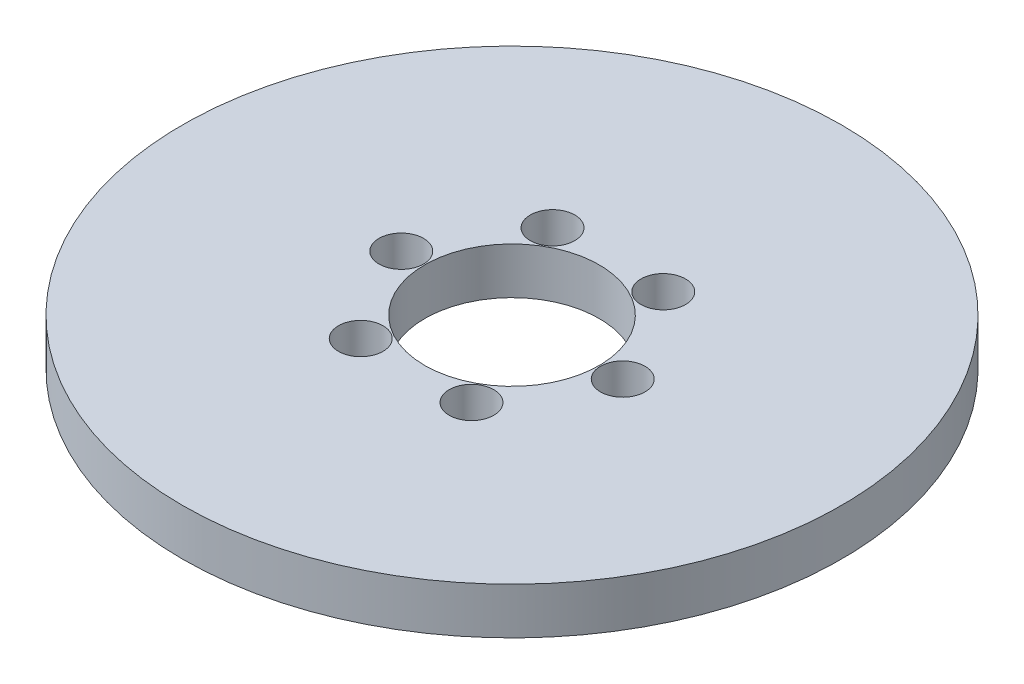
ISO-10303-21;
HEADER;
FILE_DESCRIPTION(('STEP AP214'),'2;1');
FILE_NAME('part.step','',(''),(''),'','','');
FILE_SCHEMA(('AUTOMOTIVE_DESIGN { 1 0 10303 214 1 1 1 1 }'));
ENDSEC;
DATA;
#1=APPLICATION_CONTEXT('core data for automotive mechanical design processes');
#2=APPLICATION_PROTOCOL_DEFINITION('international standard','automotive_design',2000,#1);
#3=PRODUCT_CONTEXT('',#1,'mechanical');
#4=PRODUCT('Part','Part','',(#3));
#5=PRODUCT_RELATED_PRODUCT_CATEGORY('part','',(#4));
#6=PRODUCT_DEFINITION_FORMATION('','',#4);
#7=PRODUCT_DEFINITION_CONTEXT('part definition',#1,'design');
#8=PRODUCT_DEFINITION('design','',#6,#7);
#9=PRODUCT_DEFINITION_SHAPE('','',#8);
#10=(LENGTH_UNIT() NAMED_UNIT(*) SI_UNIT(.MILLI.,.METRE.));
#11=(NAMED_UNIT(*) PLANE_ANGLE_UNIT() SI_UNIT($,.RADIAN.));
#12=(NAMED_UNIT(*) SI_UNIT($,.STERADIAN.) SOLID_ANGLE_UNIT());
#13=UNCERTAINTY_MEASURE_WITH_UNIT(LENGTH_MEASURE(1.E-05),#10,'distance_accuracy_value','');
#14=(GEOMETRIC_REPRESENTATION_CONTEXT(3) GLOBAL_UNCERTAINTY_ASSIGNED_CONTEXT((#13)) GLOBAL_UNIT_ASSIGNED_CONTEXT((#10,
#11,#12)) REPRESENTATION_CONTEXT('',''));
#15=CARTESIAN_POINT('',(0.,0.,0.));
#16=DIRECTION('',(0.,0.,1.));
#17=DIRECTION('',(1.,0.,0.));
#18=AXIS2_PLACEMENT_3D('',#15,#16,#17);
#19=CARTESIAN_POINT('',(0.,12.,0.));
#20=DIRECTION('',(0.,-1.,0.));
#21=DIRECTION('',(0.,0.,-1.));
#22=AXIS2_PLACEMENT_3D('',#19,#20,#21);
#23=CYLINDRICAL_SURFACE('',#22,85.);
#24=CARTESIAN_POINT('',(0.,12.,0.));
#25=DIRECTION('',(0.,1.,0.));
#26=DIRECTION('',(0.,0.,1.));
#27=AXIS2_PLACEMENT_3D('',#24,#25,#26);
#28=CIRCLE('',#27,85.);
#29=CARTESIAN_POINT('',(0.,12.,85.));
#30=VERTEX_POINT('',#29);
#31=EDGE_CURVE('E10',#30,#30,#28,.T.);
#32=ORIENTED_EDGE('',*,*,#31,.F.);
#33=EDGE_LOOP('',(#32));
#34=FACE_BOUND('',#33,.T.);
#35=CARTESIAN_POINT('',(0.,0.,0.));
#36=DIRECTION('',(0.,1.,0.));
#37=DIRECTION('',(0.,0.,1.));
#38=AXIS2_PLACEMENT_3D('',#35,#36,#37);
#39=CIRCLE('',#38,85.);
#40=CARTESIAN_POINT('',(0.,0.,85.));
#41=VERTEX_POINT('',#40);
#42=EDGE_CURVE('E37',#41,#41,#39,.T.);
#43=ORIENTED_EDGE('',*,*,#42,.T.);
#44=EDGE_LOOP('',(#43));
#45=FACE_BOUND('',#44,.T.);
#46=ADVANCED_FACE('F40',(#34,#45),#23,.T.);
#47=CARTESIAN_POINT('',(0.,12.,0.));
#48=DIRECTION('',(0.,1.,0.));
#49=DIRECTION('',(0.,0.,1.));
#50=AXIS2_PLACEMENT_3D('',#47,#48,#49);
#51=PLANE('',#50);
#52=CARTESIAN_POINT('',(-14.2803185229176,12.,-24.7342372299595));
#53=DIRECTION('',(0.,1.,0.));
#54=DIRECTION('',(-0.866025403784433,0.,0.50000000000001));
#55=AXIS2_PLACEMENT_3D('',#52,#53,#54);
#56=CIRCLE('',#55,5.7444583782801);
#57=CARTESIAN_POINT('',(-19.2551654094905,12.,-21.8620080408194));
#58=VERTEX_POINT('',#57);
#59=EDGE_CURVE('E70',#58,#58,#56,.T.);
#60=ORIENTED_EDGE('',*,*,#59,.F.);
#61=EDGE_LOOP('',(#60));
#62=FACE_BOUND('',#61,.T.);
#63=CARTESIAN_POINT('',(14.2803185229171,12.,-24.7342372299598));
#64=DIRECTION('',(0.,1.,0.));
#65=DIRECTION('',(-0.866025403784443,0.,-0.499999999999992));
#66=AXIS2_PLACEMENT_3D('',#63,#64,#65);
#67=CIRCLE('',#66,5.7444583782801);
#68=CARTESIAN_POINT('',(9.30547163634411,12.,-27.6064664190998));
#69=VERTEX_POINT('',#68);
#70=EDGE_CURVE('E71',#69,#69,#67,.T.);
#71=ORIENTED_EDGE('',*,*,#70,.F.);
#72=EDGE_LOOP('',(#71));
#73=FACE_BOUND('',#72,.T.);
#74=CARTESIAN_POINT('',(28.5606370458346,12.,0.));
#75=DIRECTION('',(0.,1.,0.));
#76=DIRECTION('',(0.,0.,-1.));
#77=AXIS2_PLACEMENT_3D('',#74,#75,#76);
#78=CIRCLE('',#77,5.7444583782801);
#79=CARTESIAN_POINT('',(28.5606370458346,12.,-5.7444583782801));
#80=VERTEX_POINT('',#79);
#81=EDGE_CURVE('E78',#80,#80,#78,.T.);
#82=ORIENTED_EDGE('',*,*,#81,.F.);
#83=EDGE_LOOP('',(#82));
#84=FACE_BOUND('',#83,.T.);
#85=CARTESIAN_POINT('',(14.2803185229174,12.,24.7342372299596));
#86=DIRECTION('',(0.,1.,0.));
#87=DIRECTION('',(0.866025403784436,0.,-0.500000000000004));
#88=AXIS2_PLACEMENT_3D('',#85,#86,#87);
#89=CIRCLE('',#88,5.7444583782801);
#90=CARTESIAN_POINT('',(19.2551654094903,12.,21.8620080408195));
#91=VERTEX_POINT('',#90);
#92=EDGE_CURVE('E84',#91,#91,#89,.T.);
#93=ORIENTED_EDGE('',*,*,#92,.F.);
#94=EDGE_LOOP('',(#93));
#95=FACE_BOUND('',#94,.T.);
#96=CARTESIAN_POINT('',(-14.2803185229172,12.,24.7342372299597));
#97=DIRECTION('',(0.,1.,0.));
#98=DIRECTION('',(0.86602540378444,0.,0.499999999999998));
#99=AXIS2_PLACEMENT_3D('',#96,#97,#98);
#100=CIRCLE('',#99,5.7444583782801);
#101=CARTESIAN_POINT('',(-9.3054716363443,12.,27.6064664190997));
#102=VERTEX_POINT('',#101);
#103=EDGE_CURVE('E61',#102,#102,#100,.T.);
#104=ORIENTED_EDGE('',*,*,#103,.F.);
#105=EDGE_LOOP('',(#104));
#106=FACE_BOUND('',#105,.T.);
#107=CARTESIAN_POINT('',(-28.5606370458346,12.,0.));
#108=DIRECTION('',(0.,1.,0.));
#109=DIRECTION('',(0.,0.,1.));
#110=AXIS2_PLACEMENT_3D('',#107,#108,#109);
#111=CIRCLE('',#110,5.7444583782801);
#112=CARTESIAN_POINT('',(-28.5606370458346,12.,5.7444583782801));
#113=VERTEX_POINT('',#112);
#114=EDGE_CURVE('E54',#113,#113,#111,.T.);
#115=ORIENTED_EDGE('',*,*,#114,.F.);
#116=EDGE_LOOP('',(#115));
#117=FACE_BOUND('',#116,.T.);
#118=CARTESIAN_POINT('',(0.,12.,0.));
#119=DIRECTION('',(0.,1.,0.));
#120=DIRECTION('',(0.,0.,1.));
#121=AXIS2_PLACEMENT_3D('',#118,#119,#120);
#122=CIRCLE('',#121,22.5);
#123=CARTESIAN_POINT('',(0.,12.,22.5));
#124=VERTEX_POINT('',#123);
#125=EDGE_CURVE('E50',#124,#124,#122,.T.);
#126=ORIENTED_EDGE('',*,*,#125,.F.);
#127=EDGE_LOOP('',(#126));
#128=FACE_BOUND('',#127,.T.);
#129=ORIENTED_EDGE('',*,*,#31,.T.);
#130=EDGE_LOOP('',(#129));
#131=FACE_BOUND('',#130,.T.);
#132=ADVANCED_FACE('F99',(#62,#73,#84,#95,#106,#117,#128,#131),#51,.T.);
#133=CARTESIAN_POINT('',(0.,0.,0.));
#134=DIRECTION('',(0.,1.,0.));
#135=DIRECTION('',(0.,0.,1.));
#136=AXIS2_PLACEMENT_3D('',#133,#134,#135);
#137=PLANE('',#136);
#138=CARTESIAN_POINT('',(0.,0.,0.));
#139=DIRECTION('',(0.,1.,0.));
#140=DIRECTION('',(0.,0.,1.));
#141=AXIS2_PLACEMENT_3D('',#138,#139,#140);
#142=CIRCLE('',#141,22.5);
#143=CARTESIAN_POINT('',(0.,0.,22.5));
#144=VERTEX_POINT('',#143);
#145=EDGE_CURVE('E47',#144,#144,#142,.T.);
#146=ORIENTED_EDGE('',*,*,#145,.T.);
#147=EDGE_LOOP('',(#146));
#148=FACE_BOUND('',#147,.T.);
#149=ORIENTED_EDGE('',*,*,#42,.F.);
#150=EDGE_LOOP('',(#149));
#151=FACE_BOUND('',#150,.T.);
#152=ADVANCED_FACE('F103',(#148,#151),#137,.F.);
#153=CARTESIAN_POINT('',(0.,12.,0.));
#154=DIRECTION('',(0.,-1.,0.));
#155=DIRECTION('',(0.,0.,-1.));
#156=AXIS2_PLACEMENT_3D('',#153,#154,#155);
#157=CYLINDRICAL_SURFACE('',#156,22.5);
#158=ORIENTED_EDGE('',*,*,#125,.T.);
#159=EDGE_LOOP('',(#158));
#160=FACE_BOUND('',#159,.T.);
#161=ORIENTED_EDGE('',*,*,#145,.F.);
#162=EDGE_LOOP('',(#161));
#163=FACE_BOUND('',#162,.T.);
#164=ADVANCED_FACE('F115',(#160,#163),#157,.F.);
#165=CARTESIAN_POINT('',(-28.5606370458346,3.35929411930055,0.));
#166=DIRECTION('',(0.,1.,0.));
#167=DIRECTION('',(0.,0.,1.));
#168=AXIS2_PLACEMENT_3D('',#165,#166,#167);
#169=CYLINDRICAL_SURFACE('',#168,5.7444583782801);
#170=CARTESIAN_POINT('',(-28.5606370458346,3.35929411930055,0.));
#171=DIRECTION('',(0.,1.,0.));
#172=DIRECTION('',(0.,0.,1.));
#173=AXIS2_PLACEMENT_3D('',#170,#171,#172);
#174=CIRCLE('',#173,5.7444583782801);
#175=CARTESIAN_POINT('',(-28.5606370458346,3.35929411930055,5.7444583782801));
#176=VERTEX_POINT('',#175);
#177=EDGE_CURVE('E55',#176,#176,#174,.T.);
#178=ORIENTED_EDGE('',*,*,#177,.F.);
#179=EDGE_LOOP('',(#178));
#180=FACE_BOUND('',#179,.T.);
#181=ORIENTED_EDGE('',*,*,#114,.T.);
#182=EDGE_LOOP('',(#181));
#183=FACE_BOUND('',#182,.T.);
#184=ADVANCED_FACE('F113',(#180,#183),#169,.F.);
#185=CARTESIAN_POINT('',(-28.5606370458346,3.35929411930055,0.));
#186=DIRECTION('',(0.,1.,0.));
#187=DIRECTION('',(0.,0.,1.));
#188=AXIS2_PLACEMENT_3D('',#185,#186,#187);
#189=PLANE('',#188);
#190=ORIENTED_EDGE('',*,*,#177,.T.);
#191=EDGE_LOOP('',(#190));
#192=FACE_BOUND('',#191,.T.);
#193=ADVANCED_FACE('F144',(#192),#189,.T.);
#194=CARTESIAN_POINT('',(-14.2803185229172,3.35929411930055,24.7342372299597));
#195=DIRECTION('',(0.,1.,0.));
#196=DIRECTION('',(0.,0.,1.));
#197=AXIS2_PLACEMENT_3D('',#194,#195,#196);
#198=CYLINDRICAL_SURFACE('',#197,5.7444583782801);
#199=CARTESIAN_POINT('',(-14.2803185229172,3.35929411930055,24.7342372299597));
#200=DIRECTION('',(0.,1.,0.));
#201=DIRECTION('',(0.86602540378444,0.,0.499999999999998));
#202=AXIS2_PLACEMENT_3D('',#199,#200,#201);
#203=CIRCLE('',#202,5.7444583782801);
#204=CARTESIAN_POINT('',(-9.3054716363443,3.35929411930055,27.6064664190997));
#205=VERTEX_POINT('',#204);
#206=EDGE_CURVE('E59',#205,#205,#203,.T.);
#207=ORIENTED_EDGE('',*,*,#206,.F.);
#208=EDGE_LOOP('',(#207));
#209=FACE_BOUND('',#208,.T.);
#210=ORIENTED_EDGE('',*,*,#103,.T.);
#211=EDGE_LOOP('',(#210));
#212=FACE_BOUND('',#211,.T.);
#213=ADVANCED_FACE('F153',(#209,#212),#198,.F.);
#214=CARTESIAN_POINT('',(-14.2803185229172,3.35929411930055,24.7342372299597));
#215=DIRECTION('',(0.,1.,0.));
#216=DIRECTION('',(0.86602540378444,0.,0.499999999999998));
#217=AXIS2_PLACEMENT_3D('',#214,#215,#216);
#218=PLANE('',#217);
#219=ORIENTED_EDGE('',*,*,#206,.T.);
#220=EDGE_LOOP('',(#219));
#221=FACE_BOUND('',#220,.T.);
#222=ADVANCED_FACE('F96',(#221),#218,.T.);
#223=CARTESIAN_POINT('',(14.2803185229174,3.35929411930055,24.7342372299596));
#224=DIRECTION('',(0.,1.,0.));
#225=DIRECTION('',(0.,0.,1.));
#226=AXIS2_PLACEMENT_3D('',#223,#224,#225);
#227=CYLINDRICAL_SURFACE('',#226,5.7444583782801);
#228=CARTESIAN_POINT('',(14.2803185229174,3.35929411930055,24.7342372299596));
#229=DIRECTION('',(0.,1.,0.));
#230=DIRECTION('',(0.866025403784436,0.,-0.500000000000004));
#231=AXIS2_PLACEMENT_3D('',#228,#229,#230);
#232=CIRCLE('',#231,5.7444583782801);
#233=CARTESIAN_POINT('',(19.2551654094903,3.35929411930055,21.8620080408195));
#234=VERTEX_POINT('',#233);
#235=EDGE_CURVE('E63',#234,#234,#232,.T.);
#236=ORIENTED_EDGE('',*,*,#235,.F.);
#237=EDGE_LOOP('',(#236));
#238=FACE_BOUND('',#237,.T.);
#239=ORIENTED_EDGE('',*,*,#92,.T.);
#240=EDGE_LOOP('',(#239));
#241=FACE_BOUND('',#240,.T.);
#242=ADVANCED_FACE('F91',(#238,#241),#227,.F.);
#243=CARTESIAN_POINT('',(14.2803185229174,3.35929411930055,24.7342372299596));
#244=DIRECTION('',(0.,1.,0.));
#245=DIRECTION('',(0.866025403784436,0.,-0.500000000000004));
#246=AXIS2_PLACEMENT_3D('',#243,#244,#245);
#247=PLANE('',#246);
#248=ORIENTED_EDGE('',*,*,#235,.T.);
#249=EDGE_LOOP('',(#248));
#250=FACE_BOUND('',#249,.T.);
#251=ADVANCED_FACE('F93',(#250),#247,.T.);
#252=CARTESIAN_POINT('',(28.5606370458346,3.35929411930055,0.));
#253=DIRECTION('',(0.,1.,0.));
#254=DIRECTION('',(0.,0.,1.));
#255=AXIS2_PLACEMENT_3D('',#252,#253,#254);
#256=CYLINDRICAL_SURFACE('',#255,5.7444583782801);
#257=CARTESIAN_POINT('',(28.5606370458346,3.35929411930055,0.));
#258=DIRECTION('',(0.,1.,0.));
#259=DIRECTION('',(0.,0.,-1.));
#260=AXIS2_PLACEMENT_3D('',#257,#258,#259);
#261=CIRCLE('',#260,5.7444583782801);
#262=CARTESIAN_POINT('',(28.5606370458346,3.35929411930055,-5.7444583782801));
#263=VERTEX_POINT('',#262);
#264=EDGE_CURVE('E85',#263,#263,#261,.T.);
#265=ORIENTED_EDGE('',*,*,#264,.F.);
#266=EDGE_LOOP('',(#265));
#267=FACE_BOUND('',#266,.T.);
#268=ORIENTED_EDGE('',*,*,#81,.T.);
#269=EDGE_LOOP('',(#268));
#270=FACE_BOUND('',#269,.T.);
#271=ADVANCED_FACE('F187',(#267,#270),#256,.F.);
#272=CARTESIAN_POINT('',(28.5606370458346,3.35929411930055,0.));
#273=DIRECTION('',(0.,1.,0.));
#274=DIRECTION('',(0.,0.,-1.));
#275=AXIS2_PLACEMENT_3D('',#272,#273,#274);
#276=PLANE('',#275);
#277=ORIENTED_EDGE('',*,*,#264,.T.);
#278=EDGE_LOOP('',(#277));
#279=FACE_BOUND('',#278,.T.);
#280=ADVANCED_FACE('F198',(#279),#276,.T.);
#281=CARTESIAN_POINT('',(14.2803185229171,3.35929411930055,-24.7342372299598));
#282=DIRECTION('',(0.,1.,0.));
#283=DIRECTION('',(0.,0.,1.));
#284=AXIS2_PLACEMENT_3D('',#281,#282,#283);
#285=CYLINDRICAL_SURFACE('',#284,5.7444583782801);
#286=CARTESIAN_POINT('',(14.2803185229171,3.35929411930055,-24.7342372299598));
#287=DIRECTION('',(0.,1.,0.));
#288=DIRECTION('',(-0.866025403784443,0.,-0.499999999999992));
#289=AXIS2_PLACEMENT_3D('',#286,#287,#288);
#290=CIRCLE('',#289,5.7444583782801);
#291=CARTESIAN_POINT('',(9.30547163634411,3.35929411930055,-27.6064664190998));
#292=VERTEX_POINT('',#291);
#293=EDGE_CURVE('E76',#292,#292,#290,.T.);
#294=ORIENTED_EDGE('',*,*,#293,.F.);
#295=EDGE_LOOP('',(#294));
#296=FACE_BOUND('',#295,.T.);
#297=ORIENTED_EDGE('',*,*,#70,.T.);
#298=EDGE_LOOP('',(#297));
#299=FACE_BOUND('',#298,.T.);
#300=ADVANCED_FACE('F202',(#296,#299),#285,.F.);
#301=CARTESIAN_POINT('',(14.2803185229171,3.35929411930055,-24.7342372299598));
#302=DIRECTION('',(0.,1.,0.));
#303=DIRECTION('',(-0.866025403784443,0.,-0.499999999999992));
#304=AXIS2_PLACEMENT_3D('',#301,#302,#303);
#305=PLANE('',#304);
#306=ORIENTED_EDGE('',*,*,#293,.T.);
#307=EDGE_LOOP('',(#306));
#308=FACE_BOUND('',#307,.T.);
#309=ADVANCED_FACE('F212',(#308),#305,.T.);
#310=CARTESIAN_POINT('',(-14.2803185229176,3.35929411930055,-24.7342372299595));
#311=DIRECTION('',(0.,1.,0.));
#312=DIRECTION('',(0.,0.,1.));
#313=AXIS2_PLACEMENT_3D('',#310,#311,#312);
#314=CYLINDRICAL_SURFACE('',#313,5.7444583782801);
#315=CARTESIAN_POINT('',(-14.2803185229176,3.35929411930055,-24.7342372299595));
#316=DIRECTION('',(0.,1.,0.));
#317=DIRECTION('',(-0.866025403784433,0.,0.50000000000001));
#318=AXIS2_PLACEMENT_3D('',#315,#316,#317);
#319=CIRCLE('',#318,5.7444583782801);
#320=CARTESIAN_POINT('',(-19.2551654094905,3.35929411930055,-21.8620080408194));
#321=VERTEX_POINT('',#320);
#322=EDGE_CURVE('E69',#321,#321,#319,.T.);
#323=ORIENTED_EDGE('',*,*,#322,.F.);
#324=EDGE_LOOP('',(#323));
#325=FACE_BOUND('',#324,.T.);
#326=ORIENTED_EDGE('',*,*,#59,.T.);
#327=EDGE_LOOP('',(#326));
#328=FACE_BOUND('',#327,.T.);
#329=ADVANCED_FACE('F224',(#325,#328),#314,.F.);
#330=CARTESIAN_POINT('',(-14.2803185229176,3.35929411930055,-24.7342372299595));
#331=DIRECTION('',(0.,1.,0.));
#332=DIRECTION('',(-0.866025403784433,0.,0.50000000000001));
#333=AXIS2_PLACEMENT_3D('',#330,#331,#332);
#334=PLANE('',#333);
#335=ORIENTED_EDGE('',*,*,#322,.T.);
#336=EDGE_LOOP('',(#335));
#337=FACE_BOUND('',#336,.T.);
#338=ADVANCED_FACE('F235',(#337),#334,.T.);
#339=CLOSED_SHELL('',(#46,#132,#152,#164,#184,#193,#213,#222,#242,#251,#271,#280,#300,#309,#329,#338));
#340=MANIFOLD_SOLID_BREP('B2',#339);
#341=ADVANCED_BREP_SHAPE_REPRESENTATION('',(#18,#340),#14);
#342=SHAPE_DEFINITION_REPRESENTATION(#9,#341);
ENDSEC;
END-ISO-10303-21;
